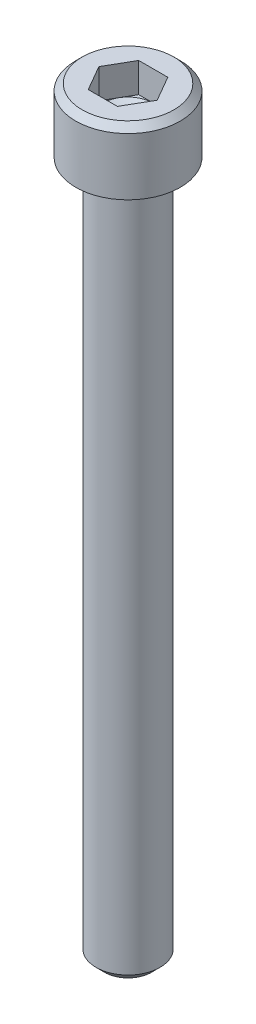
ISO-10303-21;
HEADER;
FILE_DESCRIPTION(('STEP AP214'),'2;1');
FILE_NAME('part.step','',(''),(''),'','','');
FILE_SCHEMA(('AUTOMOTIVE_DESIGN { 1 0 10303 214 1 1 1 1 }'));
ENDSEC;
DATA;
#1=APPLICATION_CONTEXT('core data for automotive mechanical design processes');
#2=APPLICATION_PROTOCOL_DEFINITION('international standard','automotive_design',2000,#1);
#3=PRODUCT_CONTEXT('',#1,'mechanical');
#4=PRODUCT('Part','Part','',(#3));
#5=PRODUCT_RELATED_PRODUCT_CATEGORY('part','',(#4));
#6=PRODUCT_DEFINITION_FORMATION('','',#4);
#7=PRODUCT_DEFINITION_CONTEXT('part definition',#1,'design');
#8=PRODUCT_DEFINITION('design','',#6,#7);
#9=PRODUCT_DEFINITION_SHAPE('','',#8);
#10=(LENGTH_UNIT() NAMED_UNIT(*) SI_UNIT(.MILLI.,.METRE.));
#11=(NAMED_UNIT(*) PLANE_ANGLE_UNIT() SI_UNIT($,.RADIAN.));
#12=(NAMED_UNIT(*) SI_UNIT($,.STERADIAN.) SOLID_ANGLE_UNIT());
#13=UNCERTAINTY_MEASURE_WITH_UNIT(LENGTH_MEASURE(1.E-05),#10,'distance_accuracy_value','');
#14=(GEOMETRIC_REPRESENTATION_CONTEXT(3) GLOBAL_UNCERTAINTY_ASSIGNED_CONTEXT((#13)) GLOBAL_UNIT_ASSIGNED_CONTEXT((#10,
#11,#12)) REPRESENTATION_CONTEXT('',''));
#15=CARTESIAN_POINT('',(0.,0.,0.));
#16=DIRECTION('',(0.,0.,1.));
#17=DIRECTION('',(1.,0.,0.));
#18=AXIS2_PLACEMENT_3D('',#15,#16,#17);
#19=CARTESIAN_POINT('',(0.,1.8796,0.));
#20=DIRECTION('',(0.,1.,0.));
#21=DIRECTION('',(0.,0.,1.));
#22=AXIS2_PLACEMENT_3D('',#19,#20,#21);
#23=PLANE('',#22);
#24=DIRECTION('',(-1.,0.,0.));
#25=VECTOR('',#24,1.);
#26=CARTESIAN_POINT('',(0.799225977638982,1.8796,-1.38429999999987));
#27=LINE('',#26,#25);
#28=CARTESIAN_POINT('',(0.799225977638982,1.8796,-1.38429999999987));
#29=VERTEX_POINT('',#28);
#30=CARTESIAN_POINT('',(0.,1.87959999999497,-1.38429999999987));
#31=VERTEX_POINT('',#30);
#32=EDGE_CURVE('E159',#29,#31,#27,.T.);
#33=ORIENTED_EDGE('',*,*,#32,.T.);
#34=CARTESIAN_POINT('',(0.,1.87959999999497,0.));
#35=DIRECTION('',(0.,-1.,0.));
#36=DIRECTION('',(0.,0.,-1.));
#37=AXIS2_PLACEMENT_3D('',#34,#35,#36);
#38=CIRCLE('',#37,1.38430000004078);
#39=CARTESIAN_POINT('',(1.19883896649411,1.87959999999497,-0.692150000020388));
#40=VERTEX_POINT('',#39);
#41=EDGE_CURVE('E47',#31,#40,#38,.T.);
#42=ORIENTED_EDGE('',*,*,#41,.T.);
#43=DIRECTION('',(-0.5,0.,-0.866025403784439));
#44=VECTOR('',#43,1.);
#45=CARTESIAN_POINT('',(1.59845195527816,1.8796,0.));
#46=LINE('',#45,#44);
#47=EDGE_CURVE('E286',#40,#29,#46,.T.);
#48=ORIENTED_EDGE('',*,*,#47,.T.);
#49=EDGE_LOOP('',(#33,#42,#48));
#50=FACE_BOUND('',#49,.T.);
#51=ADVANCED_FACE('F32',(#50),#23,.T.);
#52=CARTESIAN_POINT('',(1.59845195527816,1.8796,0.));
#53=VERTEX_POINT('',#52);
#54=EDGE_CURVE('E287',#53,#40,#46,.T.);
#55=ORIENTED_EDGE('',*,*,#54,.T.);
#56=CARTESIAN_POINT('',(1.19883896649411,1.87959999999497,0.692150000020388));
#57=VERTEX_POINT('',#56);
#58=EDGE_CURVE('E200',#40,#57,#38,.T.);
#59=ORIENTED_EDGE('',*,*,#58,.T.);
#60=DIRECTION('',(0.5,0.,-0.866025403784439));
#61=VECTOR('',#60,1.);
#62=CARTESIAN_POINT('',(0.799225977639064,1.8796,1.38429999999992));
#63=LINE('',#62,#61);
#64=EDGE_CURVE('E283',#57,#53,#63,.T.);
#65=ORIENTED_EDGE('',*,*,#64,.T.);
#66=EDGE_LOOP('',(#55,#59,#65));
#67=FACE_BOUND('',#66,.T.);
#68=ADVANCED_FACE('F122',(#67),#23,.T.);
#69=CARTESIAN_POINT('',(0.799225977639064,1.8796,1.38429999999992));
#70=VERTEX_POINT('',#69);
#71=EDGE_CURVE('E273',#70,#57,#63,.T.);
#72=ORIENTED_EDGE('',*,*,#71,.T.);
#73=CARTESIAN_POINT('',(0.,1.87959999999497,1.38430000004078));
#74=VERTEX_POINT('',#73);
#75=EDGE_CURVE('E295',#57,#74,#38,.T.);
#76=ORIENTED_EDGE('',*,*,#75,.T.);
#77=DIRECTION('',(1.,0.,0.));
#78=VECTOR('',#77,1.);
#79=CARTESIAN_POINT('',(-0.799225977639255,1.8796,1.38429999999992));
#80=LINE('',#79,#78);
#81=EDGE_CURVE('E181',#74,#70,#80,.T.);
#82=ORIENTED_EDGE('',*,*,#81,.T.);
#83=EDGE_LOOP('',(#72,#76,#82));
#84=FACE_BOUND('',#83,.T.);
#85=ADVANCED_FACE('F128',(#84),#23,.T.);
#86=CARTESIAN_POINT('',(-0.799225977639255,1.8796,1.38429999999992));
#87=VERTEX_POINT('',#86);
#88=EDGE_CURVE('E276',#87,#74,#80,.T.);
#89=ORIENTED_EDGE('',*,*,#88,.T.);
#90=CARTESIAN_POINT('',(-1.19883896649414,1.87959999999497,0.692150000020335));
#91=VERTEX_POINT('',#90);
#92=EDGE_CURVE('E282',#74,#91,#38,.T.);
#93=ORIENTED_EDGE('',*,*,#92,.T.);
#94=DIRECTION('',(0.499999999999962,0.,0.866025403784461));
#95=VECTOR('',#94,1.);
#96=CARTESIAN_POINT('',(-1.59845195527835,1.8796,0.));
#97=LINE('',#96,#95);
#98=EDGE_CURVE('E154',#91,#87,#97,.T.);
#99=ORIENTED_EDGE('',*,*,#98,.T.);
#100=EDGE_LOOP('',(#89,#93,#99));
#101=FACE_BOUND('',#100,.T.);
#102=ADVANCED_FACE('F143',(#101),#23,.T.);
#103=CARTESIAN_POINT('',(-1.59845195527835,1.8796,0.));
#104=VERTEX_POINT('',#103);
#105=EDGE_CURVE('E157',#104,#91,#97,.T.);
#106=ORIENTED_EDGE('',*,*,#105,.T.);
#107=CARTESIAN_POINT('',(-1.19883896649411,1.87959999999497,-0.692150000020388));
#108=VERTEX_POINT('',#107);
#109=EDGE_CURVE('E294',#91,#108,#38,.T.);
#110=ORIENTED_EDGE('',*,*,#109,.T.);
#111=DIRECTION('',(-0.5,0.,0.866025403784439));
#112=VECTOR('',#111,1.);
#113=CARTESIAN_POINT('',(-0.799225977639255,1.8796,-1.38429999999987));
#114=LINE('',#113,#112);
#115=EDGE_CURVE('E155',#108,#104,#114,.T.);
#116=ORIENTED_EDGE('',*,*,#115,.T.);
#117=EDGE_LOOP('',(#106,#110,#116));
#118=FACE_BOUND('',#117,.T.);
#119=ADVANCED_FACE('F134',(#118),#23,.T.);
#120=CARTESIAN_POINT('',(-0.799225977639255,1.8796,-1.38429999999987));
#121=VERTEX_POINT('',#120);
#122=EDGE_CURVE('E147',#121,#108,#114,.T.);
#123=ORIENTED_EDGE('',*,*,#122,.T.);
#124=EDGE_CURVE('E148',#108,#31,#38,.T.);
#125=ORIENTED_EDGE('',*,*,#124,.T.);
#126=EDGE_CURVE('E150',#31,#121,#27,.T.);
#127=ORIENTED_EDGE('',*,*,#126,.T.);
#128=EDGE_LOOP('',(#123,#125,#127));
#129=FACE_BOUND('',#128,.T.);
#130=ADVANCED_FACE('F124',(#129),#23,.T.);
#131=CARTESIAN_POINT('',(0.,0.,0.));
#132=DIRECTION('',(0.,-1.,0.));
#133=DIRECTION('',(0.,0.,-1.));
#134=AXIS2_PLACEMENT_3D('',#131,#132,#133);
#135=PLANE('',#134);
#136=CARTESIAN_POINT('',(0.,0.,0.));
#137=DIRECTION('',(0.,-1.,0.));
#138=DIRECTION('',(0.,0.,-1.));
#139=AXIS2_PLACEMENT_3D('',#136,#137,#138);
#140=CIRCLE('',#139,2.0066);
#141=CARTESIAN_POINT('',(0.,0.,-2.0066));
#142=VERTEX_POINT('',#141);
#143=EDGE_CURVE('E11',#142,#142,#140,.F.);
#144=ORIENTED_EDGE('',*,*,#143,.T.);
#145=EDGE_LOOP('',(#144));
#146=FACE_BOUND('',#145,.T.);
#147=CARTESIAN_POINT('',(0.,0.,0.));
#148=DIRECTION('',(0.,-1.,0.));
#149=DIRECTION('',(0.,0.,-1.));
#150=AXIS2_PLACEMENT_3D('',#147,#148,#149);
#151=CIRCLE('',#150,2.8702);
#152=CARTESIAN_POINT('',(0.,0.,-2.8702));
#153=VERTEX_POINT('',#152);
#154=EDGE_CURVE('E184',#153,#153,#151,.T.);
#155=ORIENTED_EDGE('',*,*,#154,.T.);
#156=EDGE_LOOP('',(#155));
#157=FACE_BOUND('',#156,.T.);
#158=ADVANCED_FACE('F133',(#146,#157),#135,.T.);
#159=CARTESIAN_POINT('',(0.,3.5052,0.));
#160=DIRECTION('',(0.,-1.,0.));
#161=DIRECTION('',(0.,0.,-1.));
#162=AXIS2_PLACEMENT_3D('',#159,#160,#161);
#163=CYLINDRICAL_SURFACE('',#162,2.8702);
#164=CARTESIAN_POINT('',(0.,3.14960000004543,0.));
#165=DIRECTION('',(0.,1.,0.));
#166=DIRECTION('',(0.,0.,1.));
#167=AXIS2_PLACEMENT_3D('',#164,#165,#166);
#168=CIRCLE('',#167,2.8702);
#169=CARTESIAN_POINT('',(0.,3.14960000004543,2.8702));
#170=VERTEX_POINT('',#169);
#171=EDGE_CURVE('E203',#170,#170,#168,.F.);
#172=ORIENTED_EDGE('',*,*,#171,.T.);
#173=EDGE_LOOP('',(#172));
#174=FACE_BOUND('',#173,.T.);
#175=ORIENTED_EDGE('',*,*,#154,.F.);
#176=EDGE_LOOP('',(#175));
#177=FACE_BOUND('',#176,.T.);
#178=ADVANCED_FACE('F140',(#174,#177),#163,.T.);
#179=CARTESIAN_POINT('',(2.8702,3.5052,0.));
#180=DIRECTION('',(0.,1.,0.));
#181=DIRECTION('',(0.,0.,1.));
#182=AXIS2_PLACEMENT_3D('',#179,#180,#181);
#183=PLANE('',#182);
#184=CARTESIAN_POINT('',(0.,3.5052,0.));
#185=DIRECTION('',(0.,1.,0.));
#186=DIRECTION('',(0.,0.,1.));
#187=AXIS2_PLACEMENT_3D('',#184,#185,#186);
#188=CIRCLE('',#187,2.51459999998859);
#189=CARTESIAN_POINT('',(0.,3.5052,2.51459999998859));
#190=VERTEX_POINT('',#189);
#191=EDGE_CURVE('E206',#190,#190,#188,.T.);
#192=ORIENTED_EDGE('',*,*,#191,.T.);
#193=EDGE_LOOP('',(#192));
#194=FACE_BOUND('',#193,.T.);
#195=DIRECTION('',(1.,0.,0.));
#196=VECTOR('',#195,1.);
#197=CARTESIAN_POINT('',(-0.799225977639255,3.5052,1.38429999999992));
#198=LINE('',#197,#196);
#199=CARTESIAN_POINT('',(-0.799225977639255,3.5052,1.38429999999992));
#200=VERTEX_POINT('',#199);
#201=CARTESIAN_POINT('',(0.799225977639064,3.5052,1.38429999999992));
#202=VERTEX_POINT('',#201);
#203=EDGE_CURVE('E55',#200,#202,#198,.T.);
#204=ORIENTED_EDGE('',*,*,#203,.F.);
#205=DIRECTION('',(0.499999999999962,0.,0.866025403784461));
#206=VECTOR('',#205,1.);
#207=CARTESIAN_POINT('',(-1.59845195527835,3.5052,0.));
#208=LINE('',#207,#206);
#209=CARTESIAN_POINT('',(-1.59845195527835,3.5052,0.));
#210=VERTEX_POINT('',#209);
#211=EDGE_CURVE('E178',#210,#200,#208,.T.);
#212=ORIENTED_EDGE('',*,*,#211,.F.);
#213=DIRECTION('',(-0.5,0.,0.866025403784439));
#214=VECTOR('',#213,1.);
#215=CARTESIAN_POINT('',(-0.799225977639255,3.5052,-1.38429999999987));
#216=LINE('',#215,#214);
#217=CARTESIAN_POINT('',(-0.799225977639255,3.5052,-1.38429999999987));
#218=VERTEX_POINT('',#217);
#219=EDGE_CURVE('E175',#218,#210,#216,.T.);
#220=ORIENTED_EDGE('',*,*,#219,.F.);
#221=DIRECTION('',(-1.,0.,0.));
#222=VECTOR('',#221,1.);
#223=CARTESIAN_POINT('',(0.799225977638982,3.5052,-1.38429999999987));
#224=LINE('',#223,#222);
#225=CARTESIAN_POINT('',(0.799225977638982,3.5052,-1.38429999999987));
#226=VERTEX_POINT('',#225);
#227=EDGE_CURVE('E172',#226,#218,#224,.T.);
#228=ORIENTED_EDGE('',*,*,#227,.F.);
#229=DIRECTION('',(-0.5,0.,-0.866025403784439));
#230=VECTOR('',#229,1.);
#231=CARTESIAN_POINT('',(1.59845195527816,3.5052,0.));
#232=LINE('',#231,#230);
#233=CARTESIAN_POINT('',(1.59845195527816,3.5052,0.));
#234=VERTEX_POINT('',#233);
#235=EDGE_CURVE('E169',#234,#226,#232,.T.);
#236=ORIENTED_EDGE('',*,*,#235,.F.);
#237=DIRECTION('',(0.5,0.,-0.866025403784439));
#238=VECTOR('',#237,1.);
#239=CARTESIAN_POINT('',(0.799225977639064,3.5052,1.38429999999992));
#240=LINE('',#239,#238);
#241=EDGE_CURVE('E166',#202,#234,#240,.T.);
#242=ORIENTED_EDGE('',*,*,#241,.F.);
#243=EDGE_LOOP('',(#204,#212,#220,#228,#236,#242));
#244=FACE_BOUND('',#243,.T.);
#245=ADVANCED_FACE('F225',(#194,#244),#183,.T.);
#246=CARTESIAN_POINT('',(0.,-38.1,0.));
#247=DIRECTION('',(0.,1.,0.));
#248=DIRECTION('',(0.,0.,1.));
#249=AXIS2_PLACEMENT_3D('',#246,#247,#248);
#250=CYLINDRICAL_SURFACE('',#249,1.7526);
#251=CARTESIAN_POINT('',(0.,-0.253999999999997,0.));
#252=DIRECTION('',(0.,-1.,0.));
#253=DIRECTION('',(0.,0.,-1.));
#254=AXIS2_PLACEMENT_3D('',#251,#252,#253);
#255=CIRCLE('',#254,1.7526);
#256=CARTESIAN_POINT('',(0.,-0.253999999999997,-1.7526));
#257=VERTEX_POINT('',#256);
#258=EDGE_CURVE('E40',#257,#257,#255,.T.);
#259=ORIENTED_EDGE('',*,*,#258,.T.);
#260=EDGE_LOOP('',(#259));
#261=FACE_BOUND('',#260,.T.);
#262=CARTESIAN_POINT('',(0.,-37.6275599999883,0.));
#263=DIRECTION('',(0.,-1.,0.));
#264=DIRECTION('',(0.,0.,-1.));
#265=AXIS2_PLACEMENT_3D('',#262,#263,#264);
#266=CIRCLE('',#265,1.7526);
#267=CARTESIAN_POINT('',(0.,-37.6275599999883,-1.7526));
#268=VERTEX_POINT('',#267);
#269=EDGE_CURVE('E199',#268,#268,#266,.F.);
#270=ORIENTED_EDGE('',*,*,#269,.T.);
#271=EDGE_LOOP('',(#270));
#272=FACE_BOUND('',#271,.T.);
#273=ADVANCED_FACE('F211',(#261,#272),#250,.T.);
#274=CARTESIAN_POINT('',(0.,-38.1,0.));
#275=DIRECTION('',(0.,-1.,0.));
#276=DIRECTION('',(0.,0.,-1.));
#277=AXIS2_PLACEMENT_3D('',#274,#275,#276);
#278=PLANE('',#277);
#279=CARTESIAN_POINT('',(0.,-38.1,0.));
#280=DIRECTION('',(0.,-1.,0.));
#281=DIRECTION('',(0.,0.,-1.));
#282=AXIS2_PLACEMENT_3D('',#279,#280,#281);
#283=CIRCLE('',#282,1.28015999998832);
#284=CARTESIAN_POINT('',(0.,-38.1,-1.28015999998832));
#285=VERTEX_POINT('',#284);
#286=EDGE_CURVE('E196',#285,#285,#283,.T.);
#287=ORIENTED_EDGE('',*,*,#286,.T.);
#288=EDGE_LOOP('',(#287));
#289=FACE_BOUND('',#288,.T.);
#290=ADVANCED_FACE('F236',(#289),#278,.T.);
#291=CARTESIAN_POINT('',(-0.799225977639255,1.8796,1.38429999999992));
#292=DIRECTION('',(0.,0.,1.));
#293=DIRECTION('',(1.,0.,0.));
#294=AXIS2_PLACEMENT_3D('',#291,#292,#293);
#295=PLANE('',#294);
#296=ORIENTED_EDGE('',*,*,#203,.T.);
#297=DIRECTION('',(0.,1.,0.));
#298=VECTOR('',#297,1.);
#299=CARTESIAN_POINT('',(0.799225977639064,1.8796,1.38429999999992));
#300=LINE('',#299,#298);
#301=EDGE_CURVE('E164',#70,#202,#300,.T.);
#302=ORIENTED_EDGE('',*,*,#301,.F.);
#303=ORIENTED_EDGE('',*,*,#81,.F.);
#304=ORIENTED_EDGE('',*,*,#88,.F.);
#305=DIRECTION('',(0.,1.,0.));
#306=VECTOR('',#305,1.);
#307=CARTESIAN_POINT('',(-0.799225977639255,1.8796,1.38429999999992));
#308=LINE('',#307,#306);
#309=EDGE_CURVE('E182',#87,#200,#308,.T.);
#310=ORIENTED_EDGE('',*,*,#309,.T.);
#311=EDGE_LOOP('',(#296,#302,#303,#304,#310));
#312=FACE_BOUND('',#311,.T.);
#313=ADVANCED_FACE('F239',(#312),#295,.F.);
#314=CARTESIAN_POINT('',(-1.59845195527835,1.8796,0.));
#315=DIRECTION('',(-0.866025403784461,0.,0.499999999999962));
#316=DIRECTION('',(0.499999999999962,0.,0.866025403784461));
#317=AXIS2_PLACEMENT_3D('',#314,#315,#316);
#318=PLANE('',#317);
#319=ORIENTED_EDGE('',*,*,#211,.T.);
#320=ORIENTED_EDGE('',*,*,#309,.F.);
#321=ORIENTED_EDGE('',*,*,#98,.F.);
#322=ORIENTED_EDGE('',*,*,#105,.F.);
#323=DIRECTION('',(0.,1.,0.));
#324=VECTOR('',#323,1.);
#325=CARTESIAN_POINT('',(-1.59845195527835,1.8796,0.));
#326=LINE('',#325,#324);
#327=EDGE_CURVE('E185',#104,#210,#326,.T.);
#328=ORIENTED_EDGE('',*,*,#327,.T.);
#329=EDGE_LOOP('',(#319,#320,#321,#322,#328));
#330=FACE_BOUND('',#329,.T.);
#331=ADVANCED_FACE('F242',(#330),#318,.F.);
#332=CARTESIAN_POINT('',(-0.799225977639255,1.8796,-1.38429999999987));
#333=DIRECTION('',(-0.866025403784439,0.,-0.5));
#334=DIRECTION('',(-0.5,0.,0.866025403784439));
#335=AXIS2_PLACEMENT_3D('',#332,#333,#334);
#336=PLANE('',#335);
#337=ORIENTED_EDGE('',*,*,#219,.T.);
#338=ORIENTED_EDGE('',*,*,#327,.F.);
#339=ORIENTED_EDGE('',*,*,#115,.F.);
#340=ORIENTED_EDGE('',*,*,#122,.F.);
#341=DIRECTION('',(0.,1.,0.));
#342=VECTOR('',#341,1.);
#343=CARTESIAN_POINT('',(-0.799225977639255,1.8796,-1.38429999999987));
#344=LINE('',#343,#342);
#345=EDGE_CURVE('E187',#121,#218,#344,.T.);
#346=ORIENTED_EDGE('',*,*,#345,.T.);
#347=EDGE_LOOP('',(#337,#338,#339,#340,#346));
#348=FACE_BOUND('',#347,.T.);
#349=ADVANCED_FACE('F250',(#348),#336,.F.);
#350=CARTESIAN_POINT('',(0.799225977638982,1.8796,-1.38429999999987));
#351=DIRECTION('',(0.,0.,-1.));
#352=DIRECTION('',(-1.,0.,0.));
#353=AXIS2_PLACEMENT_3D('',#350,#351,#352);
#354=PLANE('',#353);
#355=ORIENTED_EDGE('',*,*,#227,.T.);
#356=ORIENTED_EDGE('',*,*,#345,.F.);
#357=ORIENTED_EDGE('',*,*,#126,.F.);
#358=ORIENTED_EDGE('',*,*,#32,.F.);
#359=DIRECTION('',(0.,1.,0.));
#360=VECTOR('',#359,1.);
#361=CARTESIAN_POINT('',(0.799225977638982,1.8796,-1.38429999999987));
#362=LINE('',#361,#360);
#363=EDGE_CURVE('E189',#29,#226,#362,.T.);
#364=ORIENTED_EDGE('',*,*,#363,.T.);
#365=EDGE_LOOP('',(#355,#356,#357,#358,#364));
#366=FACE_BOUND('',#365,.T.);
#367=ADVANCED_FACE('F246',(#366),#354,.F.);
#368=CARTESIAN_POINT('',(1.59845195527816,1.8796,0.));
#369=DIRECTION('',(0.866025403784439,0.,-0.5));
#370=DIRECTION('',(-0.5,0.,-0.866025403784439));
#371=AXIS2_PLACEMENT_3D('',#368,#369,#370);
#372=PLANE('',#371);
#373=ORIENTED_EDGE('',*,*,#235,.T.);
#374=ORIENTED_EDGE('',*,*,#363,.F.);
#375=ORIENTED_EDGE('',*,*,#47,.F.);
#376=ORIENTED_EDGE('',*,*,#54,.F.);
#377=DIRECTION('',(0.,1.,0.));
#378=VECTOR('',#377,1.);
#379=CARTESIAN_POINT('',(1.59845195527816,1.8796,0.));
#380=LINE('',#379,#378);
#381=EDGE_CURVE('E191',#53,#234,#380,.T.);
#382=ORIENTED_EDGE('',*,*,#381,.T.);
#383=EDGE_LOOP('',(#373,#374,#375,#376,#382));
#384=FACE_BOUND('',#383,.T.);
#385=ADVANCED_FACE('F117',(#384),#372,.F.);
#386=CARTESIAN_POINT('',(0.799225977639064,1.8796,1.38429999999992));
#387=DIRECTION('',(0.866025403784439,0.,0.5));
#388=DIRECTION('',(0.5,0.,-0.866025403784439));
#389=AXIS2_PLACEMENT_3D('',#386,#387,#388);
#390=PLANE('',#389);
#391=ORIENTED_EDGE('',*,*,#241,.T.);
#392=ORIENTED_EDGE('',*,*,#381,.F.);
#393=ORIENTED_EDGE('',*,*,#64,.F.);
#394=ORIENTED_EDGE('',*,*,#71,.F.);
#395=ORIENTED_EDGE('',*,*,#301,.T.);
#396=EDGE_LOOP('',(#391,#392,#393,#394,#395));
#397=FACE_BOUND('',#396,.T.);
#398=ADVANCED_FACE('F108',(#397),#390,.F.);
#399=CARTESIAN_POINT('',(0.,1.08037402233223,0.));
#400=DIRECTION('',(0.,1.,0.));
#401=DIRECTION('',(0.,0.,1.));
#402=AXIS2_PLACEMENT_3D('',#399,#400,#401);
#403=CONICAL_SURFACE('',#402,0.,1.0471975511966);
#404=ORIENTED_EDGE('',*,*,#41,.F.);
#405=ORIENTED_EDGE('',*,*,#124,.F.);
#406=ORIENTED_EDGE('',*,*,#109,.F.);
#407=ORIENTED_EDGE('',*,*,#92,.F.);
#408=ORIENTED_EDGE('',*,*,#75,.F.);
#409=ORIENTED_EDGE('',*,*,#58,.F.);
#410=EDGE_LOOP('',(#404,#405,#406,#407,#408,#409));
#411=FACE_BOUND('',#410,.T.);
#412=CARTESIAN_POINT('',(0.,1.08037402233223,0.));
#413=VERTEX_POINT('',#412);
#414=VERTEX_LOOP('',#413);
#415=FACE_BOUND('',#414,.T.);
#416=ADVANCED_FACE('F105',(#411,#415),#403,.F.);
#417=CARTESIAN_POINT('',(0.,-38.1,0.));
#418=DIRECTION('',(0.,1.,0.));
#419=DIRECTION('',(0.,0.,1.));
#420=AXIS2_PLACEMENT_3D('',#417,#418,#419);
#421=CONICAL_SURFACE('',#420,1.28015999998832,0.785398163397434);
#422=ORIENTED_EDGE('',*,*,#269,.F.);
#423=EDGE_LOOP('',(#422));
#424=FACE_BOUND('',#423,.T.);
#425=ORIENTED_EDGE('',*,*,#286,.F.);
#426=EDGE_LOOP('',(#425));
#427=FACE_BOUND('',#426,.T.);
#428=ADVANCED_FACE('F107',(#424,#427),#421,.T.);
#429=CARTESIAN_POINT('',(0.,3.14960000004543,0.));
#430=DIRECTION('',(0.,-1.,0.));
#431=DIRECTION('',(0.,0.,-1.));
#432=AXIS2_PLACEMENT_3D('',#429,#430,#431);
#433=CONICAL_SURFACE('',#432,2.8702,0.785398163477374);
#434=ORIENTED_EDGE('',*,*,#191,.F.);
#435=EDGE_LOOP('',(#434));
#436=FACE_BOUND('',#435,.T.);
#437=ORIENTED_EDGE('',*,*,#171,.F.);
#438=EDGE_LOOP('',(#437));
#439=FACE_BOUND('',#438,.T.);
#440=ADVANCED_FACE('F114',(#436,#439),#433,.T.);
#441=CARTESIAN_POINT('',(0.,-0.253999999999997,0.));
#442=DIRECTION('',(0.,-1.,0.));
#443=DIRECTION('',(0.,0.,-1.));
#444=AXIS2_PLACEMENT_3D('',#441,#442,#443);
#445=TOROIDAL_SURFACE('',#444,2.0066,0.254);
#446=ORIENTED_EDGE('',*,*,#143,.F.);
#447=EDGE_LOOP('',(#446));
#448=FACE_BOUND('',#447,.T.);
#449=ORIENTED_EDGE('',*,*,#258,.F.);
#450=EDGE_LOOP('',(#449));
#451=FACE_BOUND('',#450,.T.);
#452=ADVANCED_FACE('F34',(#448,#451),#445,.F.);
#453=CLOSED_SHELL('',(#51,#68,#85,#102,#119,#130,#158,#178,#245,#273,#290,#313,#331,#349,#367,
#385,#398,#416,#428,#440,#452));
#454=MANIFOLD_SOLID_BREP('B2',#453);
#455=ADVANCED_BREP_SHAPE_REPRESENTATION('',(#18,#454),#14);
#456=SHAPE_DEFINITION_REPRESENTATION(#9,#455);
ENDSEC;
END-ISO-10303-21;
